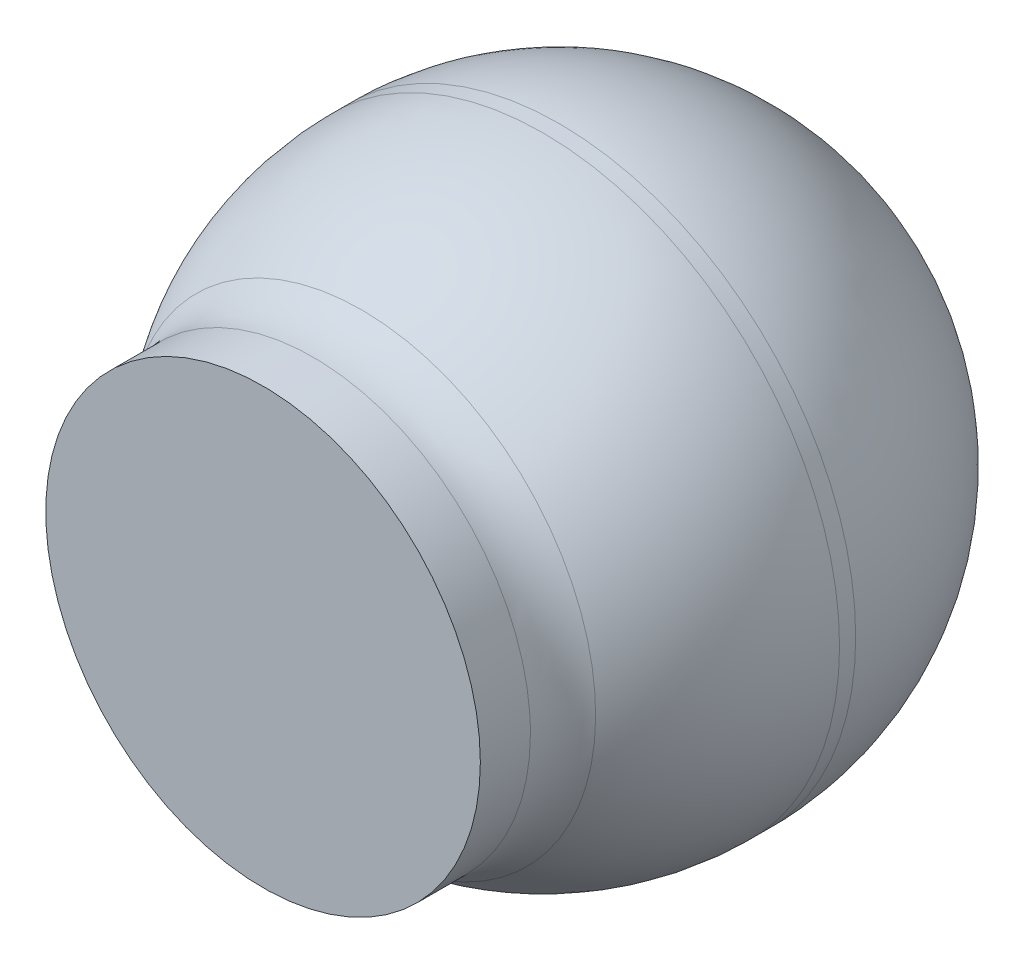
ISO-10303-21;
HEADER;
FILE_DESCRIPTION(('STEP AP214'),'2;1');
FILE_NAME('part.step','',(''),(''),'','','');
FILE_SCHEMA(('AUTOMOTIVE_DESIGN { 1 0 10303 214 1 1 1 1 }'));
ENDSEC;
DATA;
#1=APPLICATION_CONTEXT('core data for automotive mechanical design processes');
#2=APPLICATION_PROTOCOL_DEFINITION('international standard','automotive_design',2000,#1);
#3=PRODUCT_CONTEXT('',#1,'mechanical');
#4=PRODUCT('Part','Part','',(#3));
#5=PRODUCT_RELATED_PRODUCT_CATEGORY('part','',(#4));
#6=PRODUCT_DEFINITION_FORMATION('','',#4);
#7=PRODUCT_DEFINITION_CONTEXT('part definition',#1,'design');
#8=PRODUCT_DEFINITION('design','',#6,#7);
#9=PRODUCT_DEFINITION_SHAPE('','',#8);
#10=(LENGTH_UNIT() NAMED_UNIT(*) SI_UNIT(.MILLI.,.METRE.));
#11=(NAMED_UNIT(*) PLANE_ANGLE_UNIT() SI_UNIT($,.RADIAN.));
#12=(NAMED_UNIT(*) SI_UNIT($,.STERADIAN.) SOLID_ANGLE_UNIT());
#13=UNCERTAINTY_MEASURE_WITH_UNIT(LENGTH_MEASURE(1.E-05),#10,'distance_accuracy_value','');
#14=(GEOMETRIC_REPRESENTATION_CONTEXT(3) GLOBAL_UNCERTAINTY_ASSIGNED_CONTEXT((#13)) GLOBAL_UNIT_ASSIGNED_CONTEXT((#10,
#11,#12)) REPRESENTATION_CONTEXT('',''));
#15=CARTESIAN_POINT('',(0.,0.,0.));
#16=DIRECTION('',(0.,0.,1.));
#17=DIRECTION('',(1.,0.,0.));
#18=AXIS2_PLACEMENT_3D('',#15,#16,#17);
#19=CARTESIAN_POINT('',(-3.102919922269,-2.781349291452,10.006534503384));
#20=DIRECTION('',(0.,0.,-1.));
#21=DIRECTION('',(-1.,0.,0.));
#22=AXIS2_PLACEMENT_3D('',#19,#20,#21);
#23=PLANE('',#22);
#24=CARTESIAN_POINT('',(-3.102919922269,-2.781349291452,10.006534503384));
#25=DIRECTION('',(0.,0.,1.));
#26=DIRECTION('',(1.,0.,0.));
#27=AXIS2_PLACEMENT_3D('',#24,#25,#26);
#28=CIRCLE('',#27,0.275);
#29=CARTESIAN_POINT('',(-2.827919922269,-2.781349291452,10.006534503384));
#30=VERTEX_POINT('',#29);
#31=EDGE_CURVE('E20',#30,#30,#28,.F.);
#32=ORIENTED_EDGE('',*,*,#31,.F.);
#33=EDGE_LOOP('',(#32));
#34=FACE_BOUND('',#33,.T.);
#35=ADVANCED_FACE('F17',(#34),#23,.F.);
#36=CARTESIAN_POINT('',(-3.102919922269,-2.781349291452,9.906534503384));
#37=DIRECTION('',(0.,0.,1.));
#38=DIRECTION('',(1.,0.,0.));
#39=AXIS2_PLACEMENT_3D('',#36,#37,#38);
#40=CYLINDRICAL_SURFACE('',#39,0.275);
#41=CARTESIAN_POINT('',(-3.102919922269,-2.781349291452,9.943180457728));
#42=DIRECTION('',(0.,0.,-1.));
#43=DIRECTION('',(0.996700902337582,0.0811622527992454,0.));
#44=AXIS2_PLACEMENT_3D('',#41,#42,#43);
#45=CIRCLE('',#44,0.275);
#46=CARTESIAN_POINT('',(-2.82882717412616,-2.75902967193221,9.943180457728));
#47=VERTEX_POINT('',#46);
#48=EDGE_CURVE('E65',#47,#47,#45,.F.);
#49=ORIENTED_EDGE('',*,*,#48,.T.);
#50=EDGE_LOOP('',(#49));
#51=FACE_BOUND('',#50,.T.);
#52=ORIENTED_EDGE('',*,*,#31,.T.);
#53=EDGE_LOOP('',(#52));
#54=FACE_BOUND('',#53,.T.);
#55=ADVANCED_FACE('F62',(#51,#54),#40,.T.);
#56=CARTESIAN_POINT('',(-3.102919922269,-2.781349291452,9.943180457728));
#57=DIRECTION('',(0.,0.,-1.));
#58=DIRECTION('',(0.996700902337583,0.081162252799246,0.));
#59=AXIS2_PLACEMENT_3D('',#56,#57,#58);
#60=TOROIDAL_SURFACE('',#59,0.375,0.1);
#61=ORIENTED_EDGE('',*,*,#48,.F.);
#62=EDGE_LOOP('',(#61));
#63=FACE_BOUND('',#62,.T.);
#64=CARTESIAN_POINT('',(-3.102919922269,-2.781349291452,9.881744931236));
#65=DIRECTION('',(0.,0.,-1.));
#66=DIRECTION('',(-0.996700902337598,-0.0811622527990607,0.));
#67=AXIS2_PLACEMENT_3D('',#64,#65,#66);
#68=CIRCLE('',#67,0.296097046412665);
#69=CARTESIAN_POINT('',(-3.398040115608,-2.805381194786,9.881744931236));
#70=VERTEX_POINT('',#69);
#71=EDGE_CURVE('E39',#70,#70,#68,.T.);
#72=ORIENTED_EDGE('',*,*,#71,.F.);
#73=EDGE_LOOP('',(#72));
#74=FACE_BOUND('',#73,.T.);
#75=ADVANCED_FACE('F57',(#63,#74),#60,.F.);
#76=CARTESIAN_POINT('',(-3.476682760645,-2.811785136252,9.651976062157));
#77=CARTESIAN_POINT('',(-3.476682760645,-2.811785136252,9.701461392103));
#78=CARTESIAN_POINT('',(-3.468526217348,-2.811120941579,9.750947004335));
#79=CARTESIAN_POINT('',(-3.452207085349,-2.809792059952,9.798626332798));
#80=CARTESIAN_POINT('',(-3.428341390838,-2.807848654938,9.842699544317));
#81=CARTESIAN_POINT('',(-3.398040115608,-2.805381194786,9.881744931236));
#82=(BOUNDED_CURVE() B_SPLINE_CURVE(5,(#76,#77,#78,#79,#80,#81),.UNSPECIFIED.,.F.,
.F.) B_SPLINE_CURVE_WITH_KNOTS((6,6),(0.,0.661568582165),
.UNSPECIFIED.) CURVE() GEOMETRIC_REPRESENTATION_ITEM() RATIONAL_B_SPLINE_CURVE((1.,1.,1.,1.,1.,1.)) REPRESENTATION_ITEM(''));
#83=CARTESIAN_POINT('',(-3.102919922269,-2.781349291452,9.651976062157));
#84=DIRECTION('',(0.,0.,-1.));
#85=AXIS1_PLACEMENT('',#83,#84);
#86=SURFACE_OF_REVOLUTION('',#82,#85);
#87=CARTESIAN_POINT('',(-3.102919922269,-2.781349291452,9.651976062157));
#88=DIRECTION('',(0.,0.,1.));
#89=DIRECTION('',(1.,0.,0.));
#90=AXIS2_PLACEMENT_3D('',#87,#88,#89);
#91=CIRCLE('',#90,0.375);
#92=CARTESIAN_POINT('',(-2.727919922269,-2.781349291452,9.651976062157));
#93=VERTEX_POINT('',#92);
#94=EDGE_CURVE('E36',#93,#93,#91,.F.);
#95=ORIENTED_EDGE('',*,*,#94,.F.);
#96=EDGE_LOOP('',(#95));
#97=FACE_BOUND('',#96,.T.);
#98=ORIENTED_EDGE('',*,*,#71,.T.);
#99=EDGE_LOOP('',(#98));
#100=FACE_BOUND('',#99,.T.);
#101=ADVANCED_FACE('F53',(#97,#100),#86,.F.);
#102=CARTESIAN_POINT('',(-3.102919922269,-2.781349291452,9.256534503384));
#103=DIRECTION('',(0.,0.,1.));
#104=DIRECTION('',(1.,0.,0.));
#105=AXIS2_PLACEMENT_3D('',#102,#103,#104);
#106=CYLINDRICAL_SURFACE('',#105,0.375);
#107=CARTESIAN_POINT('',(-3.102919922269,-2.781349291452,9.631534503384));
#108=DIRECTION('',(0.,0.,-1.));
#109=DIRECTION('',(0.0811622527992356,-0.996700902337583,0.));
#110=AXIS2_PLACEMENT_3D('',#107,#108,#109);
#111=CIRCLE('',#110,0.375);
#112=CARTESIAN_POINT('',(-3.07248407746929,-3.15511212982859,9.631534503384));
#113=VERTEX_POINT('',#112);
#114=CARTESIAN_POINT('',(-3.13335576706871,-2.40758645307541,9.631534503384));
#115=VERTEX_POINT('',#114);
#116=EDGE_CURVE('E11',#113,#115,#111,.T.);
#117=ORIENTED_EDGE('',*,*,#116,.F.);
#118=CARTESIAN_POINT('',(-3.102919922269,-2.781349291452,9.631534503384));
#119=DIRECTION('',(0.,0.,1.));
#120=DIRECTION('',(0.0811622527992366,-0.996700902337583,0.));
#121=AXIS2_PLACEMENT_3D('',#118,#119,#120);
#122=CIRCLE('',#121,0.375);
#123=EDGE_CURVE('E25',#115,#113,#122,.F.);
#124=ORIENTED_EDGE('',*,*,#123,.F.);
#125=EDGE_LOOP('',(#117,#124));
#126=FACE_BOUND('',#125,.T.);
#127=ORIENTED_EDGE('',*,*,#94,.T.);
#128=EDGE_LOOP('',(#127));
#129=FACE_BOUND('',#128,.T.);
#130=ADVANCED_FACE('F34',(#126,#129),#106,.T.);
#131=CARTESIAN_POINT('',(-3.102919922269,-2.781349291452,9.631534503384));
#132=DIRECTION('',(0.0811622527992361,-0.996700902337583,0.));
#133=DIRECTION('',(-0.996700902337583,-0.0811622527992361,0.));
#134=AXIS2_PLACEMENT_3D('',#131,#132,#133);
#135=SPHERICAL_SURFACE('',#134,0.375);
#136=ORIENTED_EDGE('',*,*,#123,.T.);
#137=ORIENTED_EDGE('',*,*,#116,.T.);
#138=EDGE_LOOP('',(#136,#137));
#139=FACE_BOUND('',#138,.T.);
#140=ADVANCED_FACE('F32',(#139),#135,.T.);
#141=CLOSED_SHELL('',(#35,#55,#75,#101,#130,#140));
#142=MANIFOLD_SOLID_BREP('B1',#141);
#143=ADVANCED_BREP_SHAPE_REPRESENTATION('',(#18,#142),#14);
#144=SHAPE_DEFINITION_REPRESENTATION(#9,#143);
ENDSEC;
END-ISO-10303-21;
